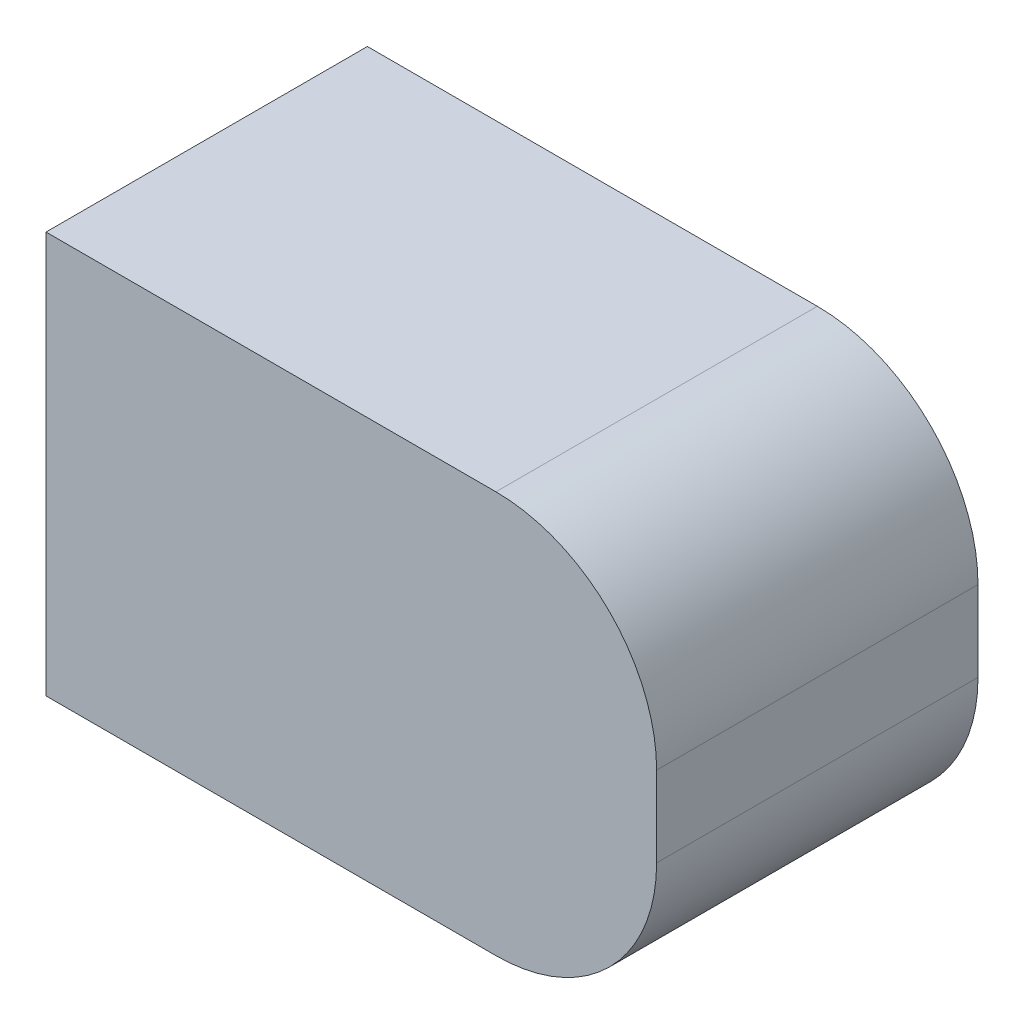
ISO-10303-21;
HEADER;
FILE_DESCRIPTION(('STEP AP214'),'2;1');
FILE_NAME('part.step','',(''),(''),'','','');
FILE_SCHEMA(('AUTOMOTIVE_DESIGN { 1 0 10303 214 1 1 1 1 }'));
ENDSEC;
DATA;
#1=APPLICATION_CONTEXT('core data for automotive mechanical design processes');
#2=APPLICATION_PROTOCOL_DEFINITION('international standard','automotive_design',2000,#1);
#3=PRODUCT_CONTEXT('',#1,'mechanical');
#4=PRODUCT('Part','Part','',(#3));
#5=PRODUCT_RELATED_PRODUCT_CATEGORY('part','',(#4));
#6=PRODUCT_DEFINITION_FORMATION('','',#4);
#7=PRODUCT_DEFINITION_CONTEXT('part definition',#1,'design');
#8=PRODUCT_DEFINITION('design','',#6,#7);
#9=PRODUCT_DEFINITION_SHAPE('','',#8);
#10=(LENGTH_UNIT() NAMED_UNIT(*) SI_UNIT(.MILLI.,.METRE.));
#11=(NAMED_UNIT(*) PLANE_ANGLE_UNIT() SI_UNIT($,.RADIAN.));
#12=(NAMED_UNIT(*) SI_UNIT($,.STERADIAN.) SOLID_ANGLE_UNIT());
#13=UNCERTAINTY_MEASURE_WITH_UNIT(LENGTH_MEASURE(1.E-05),#10,'distance_accuracy_value','');
#14=(GEOMETRIC_REPRESENTATION_CONTEXT(3) GLOBAL_UNCERTAINTY_ASSIGNED_CONTEXT((#13)) GLOBAL_UNIT_ASSIGNED_CONTEXT((#10,
#11,#12)) REPRESENTATION_CONTEXT('',''));
#15=CARTESIAN_POINT('',(0.,0.,0.));
#16=DIRECTION('',(0.,0.,1.));
#17=DIRECTION('',(1.,0.,0.));
#18=AXIS2_PLACEMENT_3D('',#15,#16,#17);
#19=CARTESIAN_POINT('',(-1.223,-0.475,0.));
#20=DIRECTION('',(0.,0.,1.));
#21=DIRECTION('',(0.707106781186548,0.707106781186547,0.));
#22=AXIS2_PLACEMENT_3D('',#19,#20,#21);
#23=CYLINDRICAL_SURFACE('',#22,0.1);
#24=CARTESIAN_POINT('',(-1.223,-0.475,0.2));
#25=DIRECTION('',(0.,0.,-1.));
#26=DIRECTION('',(0.707106781186548,0.707106781186547,0.));
#27=AXIS2_PLACEMENT_3D('',#24,#25,#26);
#28=CIRCLE('',#27,0.1);
#29=CARTESIAN_POINT('',(-1.223,-0.375000000000001,0.2));
#30=VERTEX_POINT('',#29);
#31=CARTESIAN_POINT('',(-1.123,-0.475,0.2));
#32=VERTEX_POINT('',#31);
#33=EDGE_CURVE('E11',#30,#32,#28,.T.);
#34=ORIENTED_EDGE('',*,*,#33,.T.);
#35=DIRECTION('',(0.,0.,-1.));
#36=VECTOR('',#35,1.);
#37=CARTESIAN_POINT('',(-1.123,-0.475,0.));
#38=LINE('',#37,#36);
#39=CARTESIAN_POINT('',(-1.123,-0.475,0.));
#40=VERTEX_POINT('',#39);
#41=EDGE_CURVE('E24',#32,#40,#38,.T.);
#42=ORIENTED_EDGE('',*,*,#41,.T.);
#43=CARTESIAN_POINT('',(-1.223,-0.475,0.));
#44=DIRECTION('',(0.,0.,1.));
#45=DIRECTION('',(0.707106781186548,0.707106781186547,0.));
#46=AXIS2_PLACEMENT_3D('',#43,#44,#45);
#47=CIRCLE('',#46,0.1);
#48=CARTESIAN_POINT('',(-1.223,-0.375000000000001,0.));
#49=VERTEX_POINT('',#48);
#50=EDGE_CURVE('E115',#40,#49,#47,.T.);
#51=ORIENTED_EDGE('',*,*,#50,.T.);
#52=DIRECTION('',(0.,0.,1.));
#53=VECTOR('',#52,1.);
#54=CARTESIAN_POINT('',(-1.223,-0.375000000000001,0.));
#55=LINE('',#54,#53);
#56=EDGE_CURVE('E113',#49,#30,#55,.T.);
#57=ORIENTED_EDGE('',*,*,#56,.T.);
#58=EDGE_LOOP('',(#34,#42,#51,#57));
#59=FACE_BOUND('',#58,.T.);
#60=ADVANCED_FACE('F17',(#59),#23,.T.);
#61=CARTESIAN_POINT('',(-1.313,-0.5,0.));
#62=DIRECTION('',(0.,0.,1.));
#63=DIRECTION('',(1.,0.,0.));
#64=AXIS2_PLACEMENT_3D('',#61,#62,#63);
#65=PLANE('',#64);
#66=ORIENTED_EDGE('',*,*,#50,.F.);
#67=DIRECTION('',(0.,1.,0.));
#68=VECTOR('',#67,1.);
#69=CARTESIAN_POINT('',(-1.123,-0.625000000000001,0.));
#70=LINE('',#69,#68);
#71=CARTESIAN_POINT('',(-1.123,-0.524999999999986,0.));
#72=VERTEX_POINT('',#71);
#73=EDGE_CURVE('E110',#72,#40,#70,.T.);
#74=ORIENTED_EDGE('',*,*,#73,.F.);
#75=CARTESIAN_POINT('',(-1.223,-0.524999999999986,0.));
#76=DIRECTION('',(0.,0.,1.));
#77=DIRECTION('',(0.707106781186565,-0.70710678118653,0.));
#78=AXIS2_PLACEMENT_3D('',#75,#76,#77);
#79=CIRCLE('',#78,0.1);
#80=CARTESIAN_POINT('',(-1.223,-0.624999999999986,0.));
#81=VERTEX_POINT('',#80);
#82=EDGE_CURVE('E107',#81,#72,#79,.T.);
#83=ORIENTED_EDGE('',*,*,#82,.F.);
#84=DIRECTION('',(1.,0.,0.));
#85=VECTOR('',#84,1.);
#86=CARTESIAN_POINT('',(-1.503,-0.625000000000001,0.));
#87=LINE('',#86,#85);
#88=CARTESIAN_POINT('',(-1.503,-0.625000000000001,0.));
#89=VERTEX_POINT('',#88);
#90=EDGE_CURVE('E105',#89,#81,#87,.T.);
#91=ORIENTED_EDGE('',*,*,#90,.F.);
#92=DIRECTION('',(0.,-1.,0.));
#93=VECTOR('',#92,1.);
#94=CARTESIAN_POINT('',(-1.503,-0.375000000000001,0.));
#95=LINE('',#94,#93);
#96=CARTESIAN_POINT('',(-1.503,-0.375000000000001,0.));
#97=VERTEX_POINT('',#96);
#98=EDGE_CURVE('E84',#97,#89,#95,.T.);
#99=ORIENTED_EDGE('',*,*,#98,.F.);
#100=DIRECTION('',(-1.,0.,0.));
#101=VECTOR('',#100,1.);
#102=CARTESIAN_POINT('',(-1.123,-0.375000000000001,0.));
#103=LINE('',#102,#101);
#104=EDGE_CURVE('E101',#49,#97,#103,.T.);
#105=ORIENTED_EDGE('',*,*,#104,.F.);
#106=EDGE_LOOP('',(#66,#74,#83,#91,#99,#105));
#107=FACE_BOUND('',#106,.T.);
#108=ADVANCED_FACE('F121',(#107),#65,.F.);
#109=CARTESIAN_POINT('',(-1.123,-0.625000000000001,0.));
#110=DIRECTION('',(1.,0.,0.));
#111=DIRECTION('',(0.,1.,0.));
#112=AXIS2_PLACEMENT_3D('',#109,#110,#111);
#113=PLANE('',#112);
#114=ORIENTED_EDGE('',*,*,#41,.F.);
#115=DIRECTION('',(0.,1.,0.));
#116=VECTOR('',#115,1.);
#117=CARTESIAN_POINT('',(-1.123,-0.625000000000001,0.2));
#118=LINE('',#117,#116);
#119=CARTESIAN_POINT('',(-1.123,-0.524999999999986,0.2));
#120=VERTEX_POINT('',#119);
#121=EDGE_CURVE('E99',#120,#32,#118,.T.);
#122=ORIENTED_EDGE('',*,*,#121,.F.);
#123=DIRECTION('',(0.,0.,1.));
#124=VECTOR('',#123,1.);
#125=CARTESIAN_POINT('',(-1.123,-0.524999999999986,0.));
#126=LINE('',#125,#124);
#127=EDGE_CURVE('E96',#72,#120,#126,.T.);
#128=ORIENTED_EDGE('',*,*,#127,.F.);
#129=ORIENTED_EDGE('',*,*,#73,.T.);
#130=EDGE_LOOP('',(#114,#122,#128,#129));
#131=FACE_BOUND('',#130,.T.);
#132=ADVANCED_FACE('F123',(#131),#113,.T.);
#133=CARTESIAN_POINT('',(-1.223,-0.524999999999986,0.));
#134=DIRECTION('',(0.,0.,1.));
#135=DIRECTION('',(0.707106781186565,-0.70710678118653,0.));
#136=AXIS2_PLACEMENT_3D('',#133,#134,#135);
#137=CYLINDRICAL_SURFACE('',#136,0.1);
#138=CARTESIAN_POINT('',(-1.223,-0.524999999999986,0.2));
#139=DIRECTION('',(0.,0.,-1.));
#140=DIRECTION('',(0.707106781186565,-0.70710678118653,0.));
#141=AXIS2_PLACEMENT_3D('',#138,#139,#140);
#142=CIRCLE('',#141,0.1);
#143=CARTESIAN_POINT('',(-1.223,-0.624999999999986,0.2));
#144=VERTEX_POINT('',#143);
#145=EDGE_CURVE('E94',#120,#144,#142,.T.);
#146=ORIENTED_EDGE('',*,*,#145,.T.);
#147=DIRECTION('',(0.,0.,-1.));
#148=VECTOR('',#147,1.);
#149=CARTESIAN_POINT('',(-1.223,-0.624999999999986,0.));
#150=LINE('',#149,#148);
#151=EDGE_CURVE('E73',#144,#81,#150,.T.);
#152=ORIENTED_EDGE('',*,*,#151,.T.);
#153=ORIENTED_EDGE('',*,*,#82,.T.);
#154=ORIENTED_EDGE('',*,*,#127,.T.);
#155=EDGE_LOOP('',(#146,#152,#153,#154));
#156=FACE_BOUND('',#155,.T.);
#157=ADVANCED_FACE('F125',(#156),#137,.T.);
#158=CARTESIAN_POINT('',(-1.123,-0.375000000000001,0.));
#159=DIRECTION('',(0.,1.,0.));
#160=DIRECTION('',(-1.,0.,0.));
#161=AXIS2_PLACEMENT_3D('',#158,#159,#160);
#162=PLANE('',#161);
#163=ORIENTED_EDGE('',*,*,#56,.F.);
#164=ORIENTED_EDGE('',*,*,#104,.T.);
#165=DIRECTION('',(0.,0.,1.));
#166=VECTOR('',#165,1.);
#167=CARTESIAN_POINT('',(-1.503,-0.375000000000001,0.));
#168=LINE('',#167,#166);
#169=CARTESIAN_POINT('',(-1.503,-0.375000000000001,0.2));
#170=VERTEX_POINT('',#169);
#171=EDGE_CURVE('E91',#97,#170,#168,.T.);
#172=ORIENTED_EDGE('',*,*,#171,.T.);
#173=DIRECTION('',(-1.,0.,0.));
#174=VECTOR('',#173,1.);
#175=CARTESIAN_POINT('',(-1.123,-0.375000000000001,0.2));
#176=LINE('',#175,#174);
#177=EDGE_CURVE('E76',#30,#170,#176,.T.);
#178=ORIENTED_EDGE('',*,*,#177,.F.);
#179=EDGE_LOOP('',(#163,#164,#172,#178));
#180=FACE_BOUND('',#179,.T.);
#181=ADVANCED_FACE('F127',(#180),#162,.T.);
#182=CARTESIAN_POINT('',(-1.503,-0.625000000000001,0.));
#183=DIRECTION('',(0.,-1.,0.));
#184=DIRECTION('',(1.,0.,0.));
#185=AXIS2_PLACEMENT_3D('',#182,#183,#184);
#186=PLANE('',#185);
#187=ORIENTED_EDGE('',*,*,#151,.F.);
#188=DIRECTION('',(1.,0.,0.));
#189=VECTOR('',#188,1.);
#190=CARTESIAN_POINT('',(-1.503,-0.625000000000001,0.2));
#191=LINE('',#190,#189);
#192=CARTESIAN_POINT('',(-1.503,-0.625000000000001,0.2));
#193=VERTEX_POINT('',#192);
#194=EDGE_CURVE('E67',#193,#144,#191,.T.);
#195=ORIENTED_EDGE('',*,*,#194,.F.);
#196=DIRECTION('',(0.,0.,1.));
#197=VECTOR('',#196,1.);
#198=CARTESIAN_POINT('',(-1.503,-0.625000000000001,0.));
#199=LINE('',#198,#197);
#200=EDGE_CURVE('E71',#89,#193,#199,.T.);
#201=ORIENTED_EDGE('',*,*,#200,.F.);
#202=ORIENTED_EDGE('',*,*,#90,.T.);
#203=EDGE_LOOP('',(#187,#195,#201,#202));
#204=FACE_BOUND('',#203,.T.);
#205=ADVANCED_FACE('F69',(#204),#186,.T.);
#206=CARTESIAN_POINT('',(-1.503,-0.375000000000001,0.));
#207=DIRECTION('',(-1.,0.,0.));
#208=DIRECTION('',(0.,-1.,0.));
#209=AXIS2_PLACEMENT_3D('',#206,#207,#208);
#210=PLANE('',#209);
#211=ORIENTED_EDGE('',*,*,#98,.T.);
#212=ORIENTED_EDGE('',*,*,#200,.T.);
#213=DIRECTION('',(0.,-1.,0.));
#214=VECTOR('',#213,1.);
#215=CARTESIAN_POINT('',(-1.503,-0.375000000000001,0.2));
#216=LINE('',#215,#214);
#217=EDGE_CURVE('E83',#170,#193,#216,.T.);
#218=ORIENTED_EDGE('',*,*,#217,.F.);
#219=ORIENTED_EDGE('',*,*,#171,.F.);
#220=EDGE_LOOP('',(#211,#212,#218,#219));
#221=FACE_BOUND('',#220,.T.);
#222=ADVANCED_FACE('F81',(#221),#210,.T.);
#223=CARTESIAN_POINT('',(-1.313,-0.5,0.2));
#224=DIRECTION('',(0.,0.,1.));
#225=DIRECTION('',(1.,0.,0.));
#226=AXIS2_PLACEMENT_3D('',#223,#224,#225);
#227=PLANE('',#226);
#228=ORIENTED_EDGE('',*,*,#33,.F.);
#229=ORIENTED_EDGE('',*,*,#177,.T.);
#230=ORIENTED_EDGE('',*,*,#217,.T.);
#231=ORIENTED_EDGE('',*,*,#194,.T.);
#232=ORIENTED_EDGE('',*,*,#145,.F.);
#233=ORIENTED_EDGE('',*,*,#121,.T.);
#234=EDGE_LOOP('',(#228,#229,#230,#231,#232,#233));
#235=FACE_BOUND('',#234,.T.);
#236=ADVANCED_FACE('F86',(#235),#227,.T.);
#237=CLOSED_SHELL('',(#60,#108,#132,#157,#181,#205,#222,#236));
#238=MANIFOLD_SOLID_BREP('B1',#237);
#239=ADVANCED_BREP_SHAPE_REPRESENTATION('',(#18,#238),#14);
#240=SHAPE_DEFINITION_REPRESENTATION(#9,#239);
ENDSEC;
END-ISO-10303-21;
